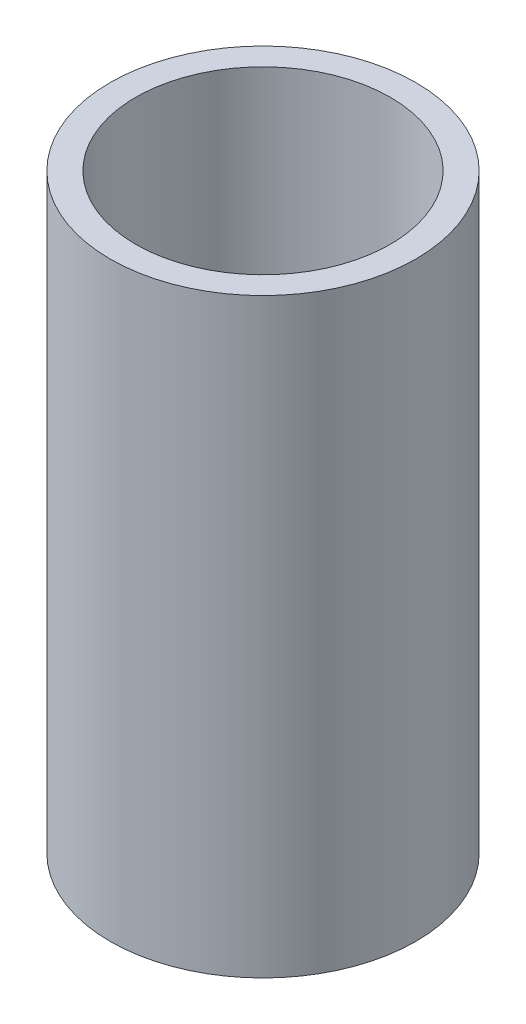
ISO-10303-21;
HEADER;
FILE_DESCRIPTION(('STEP AP214'),'2;1');
FILE_NAME('part.step','',(''),(''),'','','');
FILE_SCHEMA(('AUTOMOTIVE_DESIGN { 1 0 10303 214 1 1 1 1 }'));
ENDSEC;
DATA;
#1=APPLICATION_CONTEXT('core data for automotive mechanical design processes');
#2=APPLICATION_PROTOCOL_DEFINITION('international standard','automotive_design',2000,#1);
#3=PRODUCT_CONTEXT('',#1,'mechanical');
#4=PRODUCT('Part','Part','',(#3));
#5=PRODUCT_RELATED_PRODUCT_CATEGORY('part','',(#4));
#6=PRODUCT_DEFINITION_FORMATION('','',#4);
#7=PRODUCT_DEFINITION_CONTEXT('part definition',#1,'design');
#8=PRODUCT_DEFINITION('design','',#6,#7);
#9=PRODUCT_DEFINITION_SHAPE('','',#8);
#10=(LENGTH_UNIT() NAMED_UNIT(*) SI_UNIT(.MILLI.,.METRE.));
#11=(NAMED_UNIT(*) PLANE_ANGLE_UNIT() SI_UNIT($,.RADIAN.));
#12=(NAMED_UNIT(*) SI_UNIT($,.STERADIAN.) SOLID_ANGLE_UNIT());
#13=UNCERTAINTY_MEASURE_WITH_UNIT(LENGTH_MEASURE(1.E-05),#10,'distance_accuracy_value','');
#14=(GEOMETRIC_REPRESENTATION_CONTEXT(3) GLOBAL_UNCERTAINTY_ASSIGNED_CONTEXT((#13)) GLOBAL_UNIT_ASSIGNED_CONTEXT((#10,
#11,#12)) REPRESENTATION_CONTEXT('',''));
#15=CARTESIAN_POINT('',(0.,0.,0.));
#16=DIRECTION('',(0.,0.,1.));
#17=DIRECTION('',(1.,0.,0.));
#18=AXIS2_PLACEMENT_3D('',#15,#16,#17);
#19=CARTESIAN_POINT('',(0.,0.,0.));
#20=DIRECTION('',(0.,-1.,0.));
#21=DIRECTION('',(0.,0.,-1.));
#22=AXIS2_PLACEMENT_3D('',#19,#20,#21);
#23=CYLINDRICAL_SURFACE('',#22,43.75);
#24=CARTESIAN_POINT('',(0.,203.,0.));
#25=DIRECTION('',(0.,-1.,0.));
#26=DIRECTION('',(0.,0.,-1.));
#27=AXIS2_PLACEMENT_3D('',#24,#25,#26);
#28=CIRCLE('',#27,43.75);
#29=CARTESIAN_POINT('',(0.,203.,-43.75));
#30=VERTEX_POINT('',#29);
#31=EDGE_CURVE('E10',#30,#30,#28,.T.);
#32=ORIENTED_EDGE('',*,*,#31,.F.);
#33=EDGE_LOOP('',(#32));
#34=FACE_BOUND('',#33,.T.);
#35=CARTESIAN_POINT('',(0.,0.,0.));
#36=DIRECTION('',(0.,-1.,0.));
#37=DIRECTION('',(0.,0.,-1.));
#38=AXIS2_PLACEMENT_3D('',#35,#36,#37);
#39=CIRCLE('',#38,43.75);
#40=CARTESIAN_POINT('',(0.,0.,-43.75));
#41=VERTEX_POINT('',#40);
#42=EDGE_CURVE('E56',#41,#41,#39,.T.);
#43=ORIENTED_EDGE('',*,*,#42,.T.);
#44=EDGE_LOOP('',(#43));
#45=FACE_BOUND('',#44,.T.);
#46=ADVANCED_FACE('F39',(#34,#45),#23,.F.);
#47=CARTESIAN_POINT('',(-43.75,203.,0.));
#48=DIRECTION('',(0.,-1.,0.));
#49=DIRECTION('',(0.,0.,-1.));
#50=AXIS2_PLACEMENT_3D('',#47,#48,#49);
#51=PLANE('',#50);
#52=CARTESIAN_POINT('',(0.,203.,0.));
#53=DIRECTION('',(0.,-1.,0.));
#54=DIRECTION('',(0.,0.,-1.));
#55=AXIS2_PLACEMENT_3D('',#52,#53,#54);
#56=CIRCLE('',#55,52.5);
#57=CARTESIAN_POINT('',(0.,203.,-52.5));
#58=VERTEX_POINT('',#57);
#59=EDGE_CURVE('E46',#58,#58,#56,.T.);
#60=ORIENTED_EDGE('',*,*,#59,.F.);
#61=EDGE_LOOP('',(#60));
#62=FACE_BOUND('',#61,.T.);
#63=ORIENTED_EDGE('',*,*,#31,.T.);
#64=EDGE_LOOP('',(#63));
#65=FACE_BOUND('',#64,.T.);
#66=ADVANCED_FACE('F72',(#62,#65),#51,.F.);
#67=CARTESIAN_POINT('',(0.,0.,0.));
#68=DIRECTION('',(0.,-1.,0.));
#69=DIRECTION('',(0.,0.,-1.));
#70=AXIS2_PLACEMENT_3D('',#67,#68,#69);
#71=CYLINDRICAL_SURFACE('',#70,52.5);
#72=CARTESIAN_POINT('',(0.,0.,0.));
#73=DIRECTION('',(0.,-1.,0.));
#74=DIRECTION('',(0.,0.,-1.));
#75=AXIS2_PLACEMENT_3D('',#72,#73,#74);
#76=CIRCLE('',#75,52.5);
#77=CARTESIAN_POINT('',(0.,0.,-52.5));
#78=VERTEX_POINT('',#77);
#79=EDGE_CURVE('E51',#78,#78,#76,.T.);
#80=ORIENTED_EDGE('',*,*,#79,.F.);
#81=EDGE_LOOP('',(#80));
#82=FACE_BOUND('',#81,.T.);
#83=ORIENTED_EDGE('',*,*,#59,.T.);
#84=EDGE_LOOP('',(#83));
#85=FACE_BOUND('',#84,.T.);
#86=ADVANCED_FACE('F67',(#82,#85),#71,.T.);
#87=CARTESIAN_POINT('',(-52.5,0.,0.));
#88=DIRECTION('',(0.,1.,0.));
#89=DIRECTION('',(0.,0.,1.));
#90=AXIS2_PLACEMENT_3D('',#87,#88,#89);
#91=PLANE('',#90);
#92=ORIENTED_EDGE('',*,*,#42,.F.);
#93=EDGE_LOOP('',(#92));
#94=FACE_BOUND('',#93,.T.);
#95=ORIENTED_EDGE('',*,*,#79,.T.);
#96=EDGE_LOOP('',(#95));
#97=FACE_BOUND('',#96,.T.);
#98=ADVANCED_FACE('F64',(#94,#97),#91,.F.);
#99=CLOSED_SHELL('',(#46,#66,#86,#98));
#100=MANIFOLD_SOLID_BREP('B2',#99);
#101=ADVANCED_BREP_SHAPE_REPRESENTATION('',(#18,#100),#14);
#102=SHAPE_DEFINITION_REPRESENTATION(#9,#101);
ENDSEC;
END-ISO-10303-21;
